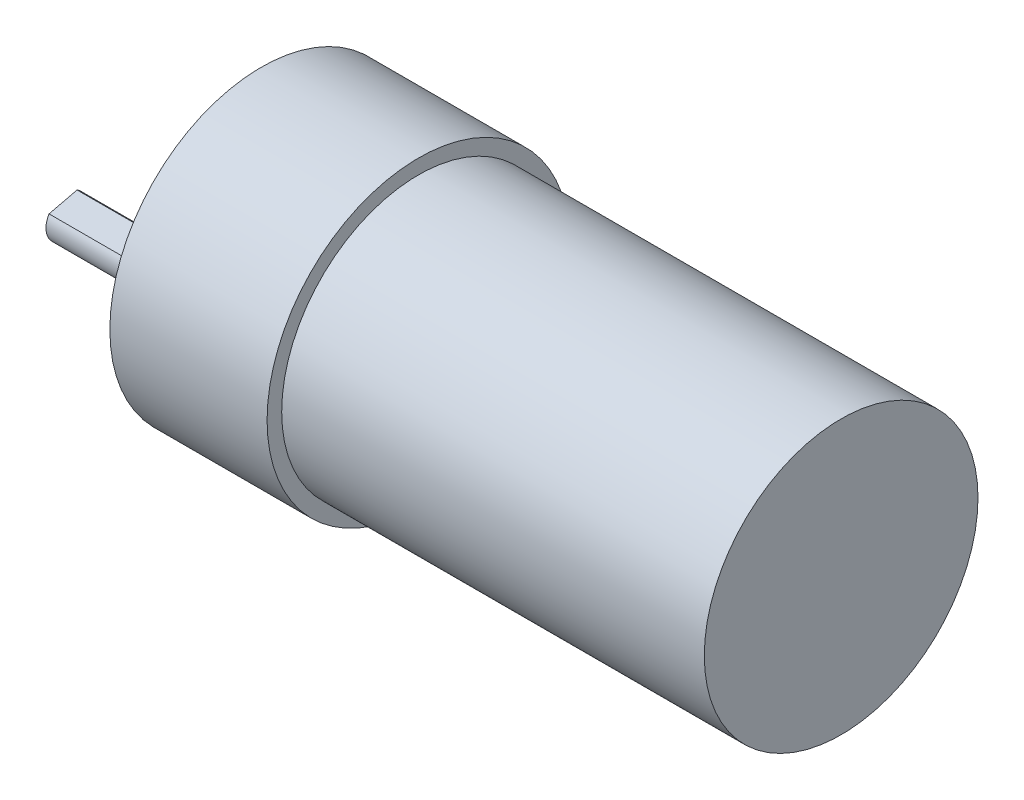
ISO-10303-21;
HEADER;
FILE_DESCRIPTION(('STEP AP214'),'2;1');
FILE_NAME('part.step','',(''),(''),'','','');
FILE_SCHEMA(('AUTOMOTIVE_DESIGN { 1 0 10303 214 1 1 1 1 }'));
ENDSEC;
DATA;
#1=APPLICATION_CONTEXT('core data for automotive mechanical design processes');
#2=APPLICATION_PROTOCOL_DEFINITION('international standard','automotive_design',2000,#1);
#3=PRODUCT_CONTEXT('',#1,'mechanical');
#4=PRODUCT('Part','Part','',(#3));
#5=PRODUCT_RELATED_PRODUCT_CATEGORY('part','',(#4));
#6=PRODUCT_DEFINITION_FORMATION('','',#4);
#7=PRODUCT_DEFINITION_CONTEXT('part definition',#1,'design');
#8=PRODUCT_DEFINITION('design','',#6,#7);
#9=PRODUCT_DEFINITION_SHAPE('','',#8);
#10=(LENGTH_UNIT() NAMED_UNIT(*) SI_UNIT(.MILLI.,.METRE.));
#11=(NAMED_UNIT(*) PLANE_ANGLE_UNIT() SI_UNIT($,.RADIAN.));
#12=(NAMED_UNIT(*) SI_UNIT($,.STERADIAN.) SOLID_ANGLE_UNIT());
#13=UNCERTAINTY_MEASURE_WITH_UNIT(LENGTH_MEASURE(1.E-05),#10,'distance_accuracy_value','');
#14=(GEOMETRIC_REPRESENTATION_CONTEXT(3) GLOBAL_UNCERTAINTY_ASSIGNED_CONTEXT((#13)) GLOBAL_UNIT_ASSIGNED_CONTEXT((#10,
#11,#12)) REPRESENTATION_CONTEXT('',''));
#15=CARTESIAN_POINT('',(0.,0.,0.));
#16=DIRECTION('',(0.,0.,1.));
#17=DIRECTION('',(1.,0.,0.));
#18=AXIS2_PLACEMENT_3D('',#15,#16,#17);
#19=CARTESIAN_POINT('',(-40.8432,-8.71855,0.));
#20=DIRECTION('',(1.,0.,0.));
#21=DIRECTION('',(0.,0.,-1.));
#22=AXIS2_PLACEMENT_3D('',#19,#20,#21);
#23=CYLINDRICAL_SURFACE('',#22,2.3749);
#24=CARTESIAN_POINT('',(-18.2372,-8.71855,0.));
#25=DIRECTION('',(-1.,0.,0.));
#26=DIRECTION('',(0.,0.,1.));
#27=AXIS2_PLACEMENT_3D('',#24,#25,#26);
#28=CIRCLE('',#27,2.3749);
#29=CARTESIAN_POINT('',(-18.2372,-8.71855,2.3749));
#30=VERTEX_POINT('',#29);
#31=EDGE_CURVE('E89',#30,#30,#28,.T.);
#32=ORIENTED_EDGE('',*,*,#31,.T.);
#33=EDGE_LOOP('',(#32));
#34=FACE_BOUND('',#33,.T.);
#35=DIRECTION('',(1.,0.,0.));
#36=VECTOR('',#35,1.);
#37=CARTESIAN_POINT('',(-40.8432,-6.68747817064265,-1.23081161596361));
#38=LINE('',#37,#36);
#39=CARTESIAN_POINT('',(-25.8572,-6.68747817064265,-1.23081161596361));
#40=VERTEX_POINT('',#39);
#41=CARTESIAN_POINT('',(-40.8432,-6.68747817064265,-1.23081161596361));
#42=VERTEX_POINT('',#41);
#43=EDGE_CURVE('E50',#40,#42,#38,.F.);
#44=ORIENTED_EDGE('',*,*,#43,.F.);
#45=CARTESIAN_POINT('',(-25.8572,-8.71855,0.));
#46=DIRECTION('',(1.,0.,0.));
#47=DIRECTION('',(0.,0.,-1.));
#48=AXIS2_PLACEMENT_3D('',#45,#46,#47);
#49=CIRCLE('',#48,2.3749);
#50=CARTESIAN_POINT('',(-25.8572,-7.46406700754952,2.01653723785416));
#51=VERTEX_POINT('',#50);
#52=EDGE_CURVE('E11',#40,#51,#49,.T.);
#53=ORIENTED_EDGE('',*,*,#52,.T.);
#54=DIRECTION('',(1.,0.,0.));
#55=VECTOR('',#54,1.);
#56=CARTESIAN_POINT('',(-40.8432,-7.46406700754952,2.01653723785416));
#57=LINE('',#56,#55);
#58=CARTESIAN_POINT('',(-40.8432,-7.46406700754952,2.01653723785416));
#59=VERTEX_POINT('',#58);
#60=EDGE_CURVE('E59',#59,#51,#57,.T.);
#61=ORIENTED_EDGE('',*,*,#60,.F.);
#62=CARTESIAN_POINT('',(-40.8432,-8.71855,0.));
#63=DIRECTION('',(-1.,0.,0.));
#64=DIRECTION('',(0.,0.,1.));
#65=AXIS2_PLACEMENT_3D('',#62,#63,#64);
#66=CIRCLE('',#65,2.3749);
#67=EDGE_CURVE('E71',#42,#59,#66,.T.);
#68=ORIENTED_EDGE('',*,*,#67,.F.);
#69=EDGE_LOOP('',(#44,#53,#61,#68));
#70=FACE_BOUND('',#69,.T.);
#71=ADVANCED_FACE('F35',(#34,#70),#23,.T.);
#72=CARTESIAN_POINT('',(-40.8432,-8.71855,0.));
#73=DIRECTION('',(-1.,0.,0.));
#74=DIRECTION('',(0.,0.,1.));
#75=AXIS2_PLACEMENT_3D('',#72,#73,#74);
#76=PLANE('',#75);
#77=ORIENTED_EDGE('',*,*,#67,.T.);
#78=DIRECTION('',(0.,0.232587064676617,-0.972575579245703));
#79=VECTOR('',#78,1.);
#80=CARTESIAN_POINT('',(-40.8432,-7.07577258909608,0.392862810945275));
#81=LINE('',#80,#79);
#82=EDGE_CURVE('E43',#59,#42,#81,.T.);
#83=ORIENTED_EDGE('',*,*,#82,.T.);
#84=EDGE_LOOP('',(#77,#83));
#85=FACE_BOUND('',#84,.T.);
#86=ADVANCED_FACE('F107',(#85),#76,.T.);
#87=CARTESIAN_POINT('',(-18.2372,0.,0.));
#88=DIRECTION('',(-1.,0.,0.));
#89=DIRECTION('',(0.,0.,1.));
#90=AXIS2_PLACEMENT_3D('',#87,#88,#89);
#91=PLANE('',#90);
#92=CARTESIAN_POINT('',(-18.2372,-8.71855,-10.2108));
#93=DIRECTION('',(-1.,0.,0.));
#94=DIRECTION('',(0.,0.,1.));
#95=AXIS2_PLACEMENT_3D('',#92,#93,#94);
#96=CIRCLE('',#95,1.27);
#97=CARTESIAN_POINT('',(-18.2372,-8.71855,-8.9408));
#98=VERTEX_POINT('',#97);
#99=EDGE_CURVE('E66',#98,#98,#96,.T.);
#100=ORIENTED_EDGE('',*,*,#99,.F.);
#101=EDGE_LOOP('',(#100));
#102=FACE_BOUND('',#101,.T.);
#103=CARTESIAN_POINT('',(-18.2372,-8.71855,10.2108));
#104=DIRECTION('',(-1.,0.,0.));
#105=DIRECTION('',(0.,0.,1.));
#106=AXIS2_PLACEMENT_3D('',#103,#104,#105);
#107=CIRCLE('',#106,1.27);
#108=CARTESIAN_POINT('',(-18.2372,-8.71855,11.4808));
#109=VERTEX_POINT('',#108);
#110=EDGE_CURVE('E77',#109,#109,#107,.T.);
#111=ORIENTED_EDGE('',*,*,#110,.F.);
#112=EDGE_LOOP('',(#111));
#113=FACE_BOUND('',#112,.T.);
#114=CARTESIAN_POINT('',(-18.2372,13.45565,0.));
#115=DIRECTION('',(-1.,0.,0.));
#116=DIRECTION('',(0.,0.,1.));
#117=AXIS2_PLACEMENT_3D('',#114,#115,#116);
#118=CIRCLE('',#117,1.27);
#119=CARTESIAN_POINT('',(-18.2372,13.45565,1.27));
#120=VERTEX_POINT('',#119);
#121=EDGE_CURVE('E83',#120,#120,#118,.T.);
#122=ORIENTED_EDGE('',*,*,#121,.F.);
#123=EDGE_LOOP('',(#122));
#124=FACE_BOUND('',#123,.T.);
#125=CARTESIAN_POINT('',(-18.2372,0.,0.));
#126=DIRECTION('',(-1.,0.,0.));
#127=DIRECTION('',(0.,0.,1.));
#128=AXIS2_PLACEMENT_3D('',#125,#126,#127);
#129=CIRCLE('',#128,17.56918);
#130=CARTESIAN_POINT('',(-18.2372,0.,17.56918));
#131=VERTEX_POINT('',#130);
#132=EDGE_CURVE('E96',#131,#131,#129,.T.);
#133=ORIENTED_EDGE('',*,*,#132,.T.);
#134=EDGE_LOOP('',(#133));
#135=FACE_BOUND('',#134,.T.);
#136=ORIENTED_EDGE('',*,*,#31,.F.);
#137=EDGE_LOOP('',(#136));
#138=FACE_BOUND('',#137,.T.);
#139=ADVANCED_FACE('F109',(#102,#113,#124,#135,#138),#91,.T.);
#140=CARTESIAN_POINT('',(49.022,0.,0.));
#141=DIRECTION('',(-1.,0.,0.));
#142=DIRECTION('',(0.,0.,1.));
#143=AXIS2_PLACEMENT_3D('',#140,#141,#142);
#144=CYLINDRICAL_SURFACE('',#143,15.875);
#145=CARTESIAN_POINT('',(49.022,0.,0.));
#146=DIRECTION('',(1.,0.,0.));
#147=DIRECTION('',(0.,0.,-1.));
#148=AXIS2_PLACEMENT_3D('',#145,#146,#147);
#149=CIRCLE('',#148,15.875);
#150=CARTESIAN_POINT('',(49.022,0.,-15.875));
#151=VERTEX_POINT('',#150);
#152=EDGE_CURVE('E104',#151,#151,#149,.T.);
#153=ORIENTED_EDGE('',*,*,#152,.F.);
#154=EDGE_LOOP('',(#153));
#155=FACE_BOUND('',#154,.T.);
#156=CARTESIAN_POINT('',(0.,0.,0.));
#157=DIRECTION('',(-1.,0.,0.));
#158=DIRECTION('',(0.,0.,1.));
#159=AXIS2_PLACEMENT_3D('',#156,#157,#158);
#160=CIRCLE('',#159,15.875);
#161=CARTESIAN_POINT('',(0.,0.,15.875));
#162=VERTEX_POINT('',#161);
#163=EDGE_CURVE('E99',#162,#162,#160,.T.);
#164=ORIENTED_EDGE('',*,*,#163,.F.);
#165=EDGE_LOOP('',(#164));
#166=FACE_BOUND('',#165,.T.);
#167=ADVANCED_FACE('F37',(#155,#166),#144,.T.);
#168=CARTESIAN_POINT('',(49.022,0.,0.));
#169=DIRECTION('',(1.,0.,0.));
#170=DIRECTION('',(0.,0.,-1.));
#171=AXIS2_PLACEMENT_3D('',#168,#169,#170);
#172=PLANE('',#171);
#173=ORIENTED_EDGE('',*,*,#152,.T.);
#174=EDGE_LOOP('',(#173));
#175=FACE_BOUND('',#174,.T.);
#176=ADVANCED_FACE('F127',(#175),#172,.T.);
#177=CARTESIAN_POINT('',(0.,0.,0.));
#178=DIRECTION('',(-1.,0.,0.));
#179=DIRECTION('',(0.,0.,1.));
#180=AXIS2_PLACEMENT_3D('',#177,#178,#179);
#181=PLANE('',#180);
#182=CARTESIAN_POINT('',(0.,0.,0.));
#183=DIRECTION('',(-1.,0.,0.));
#184=DIRECTION('',(0.,0.,1.));
#185=AXIS2_PLACEMENT_3D('',#182,#183,#184);
#186=CIRCLE('',#185,17.56918);
#187=CARTESIAN_POINT('',(0.,0.,17.56918));
#188=VERTEX_POINT('',#187);
#189=EDGE_CURVE('E93',#188,#188,#186,.T.);
#190=ORIENTED_EDGE('',*,*,#189,.F.);
#191=EDGE_LOOP('',(#190));
#192=FACE_BOUND('',#191,.T.);
#193=ORIENTED_EDGE('',*,*,#163,.T.);
#194=EDGE_LOOP('',(#193));
#195=FACE_BOUND('',#194,.T.);
#196=ADVANCED_FACE('F123',(#192,#195),#181,.F.);
#197=CARTESIAN_POINT('',(-18.2372,0.,0.));
#198=DIRECTION('',(1.,0.,0.));
#199=DIRECTION('',(0.,0.,-1.));
#200=AXIS2_PLACEMENT_3D('',#197,#198,#199);
#201=CYLINDRICAL_SURFACE('',#200,17.56918);
#202=ORIENTED_EDGE('',*,*,#132,.F.);
#203=EDGE_LOOP('',(#202));
#204=FACE_BOUND('',#203,.T.);
#205=ORIENTED_EDGE('',*,*,#189,.T.);
#206=EDGE_LOOP('',(#205));
#207=FACE_BOUND('',#206,.T.);
#208=ADVANCED_FACE('F126',(#204,#207),#201,.T.);
#209=CARTESIAN_POINT('',(-8.2372,13.45565,0.));
#210=DIRECTION('',(-1.,0.,0.));
#211=DIRECTION('',(0.,0.,1.));
#212=AXIS2_PLACEMENT_3D('',#209,#210,#211);
#213=CYLINDRICAL_SURFACE('',#212,1.27);
#214=CARTESIAN_POINT('',(-8.2372,13.45565,0.));
#215=DIRECTION('',(-1.,0.,0.));
#216=DIRECTION('',(0.,0.,1.));
#217=AXIS2_PLACEMENT_3D('',#214,#215,#216);
#218=CIRCLE('',#217,1.27);
#219=CARTESIAN_POINT('',(-8.2372,13.45565,1.27));
#220=VERTEX_POINT('',#219);
#221=EDGE_CURVE('E86',#220,#220,#218,.T.);
#222=ORIENTED_EDGE('',*,*,#221,.F.);
#223=EDGE_LOOP('',(#222));
#224=FACE_BOUND('',#223,.T.);
#225=ORIENTED_EDGE('',*,*,#121,.T.);
#226=EDGE_LOOP('',(#225));
#227=FACE_BOUND('',#226,.T.);
#228=ADVANCED_FACE('F120',(#224,#227),#213,.F.);
#229=CARTESIAN_POINT('',(-8.2372,13.45565,0.));
#230=DIRECTION('',(-1.,0.,0.));
#231=DIRECTION('',(0.,0.,1.));
#232=AXIS2_PLACEMENT_3D('',#229,#230,#231);
#233=PLANE('',#232);
#234=ORIENTED_EDGE('',*,*,#221,.T.);
#235=EDGE_LOOP('',(#234));
#236=FACE_BOUND('',#235,.T.);
#237=ADVANCED_FACE('F155',(#236),#233,.T.);
#238=CARTESIAN_POINT('',(-8.2372,-8.71855,10.2108));
#239=DIRECTION('',(-1.,0.,0.));
#240=DIRECTION('',(0.,0.,1.));
#241=AXIS2_PLACEMENT_3D('',#238,#239,#240);
#242=CYLINDRICAL_SURFACE('',#241,1.27);
#243=CARTESIAN_POINT('',(-8.2372,-8.71855,10.2108));
#244=DIRECTION('',(-1.,0.,0.));
#245=DIRECTION('',(0.,0.,1.));
#246=AXIS2_PLACEMENT_3D('',#243,#244,#245);
#247=CIRCLE('',#246,1.27);
#248=CARTESIAN_POINT('',(-8.2372,-8.71855,11.4808));
#249=VERTEX_POINT('',#248);
#250=EDGE_CURVE('E80',#249,#249,#247,.T.);
#251=ORIENTED_EDGE('',*,*,#250,.F.);
#252=EDGE_LOOP('',(#251));
#253=FACE_BOUND('',#252,.T.);
#254=ORIENTED_EDGE('',*,*,#110,.T.);
#255=EDGE_LOOP('',(#254));
#256=FACE_BOUND('',#255,.T.);
#257=ADVANCED_FACE('F160',(#253,#256),#242,.F.);
#258=CARTESIAN_POINT('',(-8.2372,-8.71855,10.2108));
#259=DIRECTION('',(-1.,0.,0.));
#260=DIRECTION('',(0.,0.,1.));
#261=AXIS2_PLACEMENT_3D('',#258,#259,#260);
#262=PLANE('',#261);
#263=ORIENTED_EDGE('',*,*,#250,.T.);
#264=EDGE_LOOP('',(#263));
#265=FACE_BOUND('',#264,.T.);
#266=ADVANCED_FACE('F165',(#265),#262,.T.);
#267=CARTESIAN_POINT('',(-8.2372,-8.71855,-10.2108));
#268=DIRECTION('',(-1.,0.,0.));
#269=DIRECTION('',(0.,0.,1.));
#270=AXIS2_PLACEMENT_3D('',#267,#268,#269);
#271=CYLINDRICAL_SURFACE('',#270,1.27);
#272=CARTESIAN_POINT('',(-8.2372,-8.71855,-10.2108));
#273=DIRECTION('',(-1.,0.,0.));
#274=DIRECTION('',(0.,0.,1.));
#275=AXIS2_PLACEMENT_3D('',#272,#273,#274);
#276=CIRCLE('',#275,1.27);
#277=CARTESIAN_POINT('',(-8.2372,-8.71855,-8.9408));
#278=VERTEX_POINT('',#277);
#279=EDGE_CURVE('E74',#278,#278,#276,.T.);
#280=ORIENTED_EDGE('',*,*,#279,.F.);
#281=EDGE_LOOP('',(#280));
#282=FACE_BOUND('',#281,.T.);
#283=ORIENTED_EDGE('',*,*,#99,.T.);
#284=EDGE_LOOP('',(#283));
#285=FACE_BOUND('',#284,.T.);
#286=ADVANCED_FACE('F175',(#282,#285),#271,.F.);
#287=CARTESIAN_POINT('',(-8.2372,-8.71855,-10.2108));
#288=DIRECTION('',(-1.,0.,0.));
#289=DIRECTION('',(0.,0.,1.));
#290=AXIS2_PLACEMENT_3D('',#287,#288,#289);
#291=PLANE('',#290);
#292=ORIENTED_EDGE('',*,*,#279,.T.);
#293=EDGE_LOOP('',(#292));
#294=FACE_BOUND('',#293,.T.);
#295=ADVANCED_FACE('F185',(#294),#291,.T.);
#296=CARTESIAN_POINT('',(-25.8572,-8.21958385216718,5.17577239912827));
#297=DIRECTION('',(1.,0.,0.));
#298=DIRECTION('',(0.,0.,-1.));
#299=AXIS2_PLACEMENT_3D('',#296,#297,#298);
#300=PLANE('',#299);
#301=DIRECTION('',(0.,0.232587064676617,-0.972575579245703));
#302=VECTOR('',#301,1.);
#303=CARTESIAN_POINT('',(-25.8572,-8.21958385216718,5.17577239912827));
#304=LINE('',#303,#302);
#305=EDGE_CURVE('E62',#51,#40,#304,.T.);
#306=ORIENTED_EDGE('',*,*,#305,.F.);
#307=ORIENTED_EDGE('',*,*,#52,.F.);
#308=EDGE_LOOP('',(#306,#307));
#309=FACE_BOUND('',#308,.T.);
#310=ADVANCED_FACE('F69',(#309),#300,.F.);
#311=CARTESIAN_POINT('',(-25.8572,-5.65789785603313,-5.5360582222337));
#312=DIRECTION('',(0.,0.972575579245703,0.232587064676617));
#313=DIRECTION('',(0.,-0.232587064676617,0.972575579245703));
#314=AXIS2_PLACEMENT_3D('',#311,#312,#313);
#315=PLANE('',#314);
#316=ORIENTED_EDGE('',*,*,#60,.T.);
#317=ORIENTED_EDGE('',*,*,#305,.T.);
#318=ORIENTED_EDGE('',*,*,#43,.T.);
#319=ORIENTED_EDGE('',*,*,#82,.F.);
#320=EDGE_LOOP('',(#316,#317,#318,#319));
#321=FACE_BOUND('',#320,.T.);
#322=ADVANCED_FACE('F61',(#321),#315,.T.);
#323=CLOSED_SHELL('',(#71,#86,#139,#167,#176,#196,#208,#228,#237,#257,#266,#286,#295,#310,#322));
#324=MANIFOLD_SOLID_BREP('B2',#323);
#325=ADVANCED_BREP_SHAPE_REPRESENTATION('',(#18,#324),#14);
#326=SHAPE_DEFINITION_REPRESENTATION(#9,#325);
ENDSEC;
END-ISO-10303-21;
